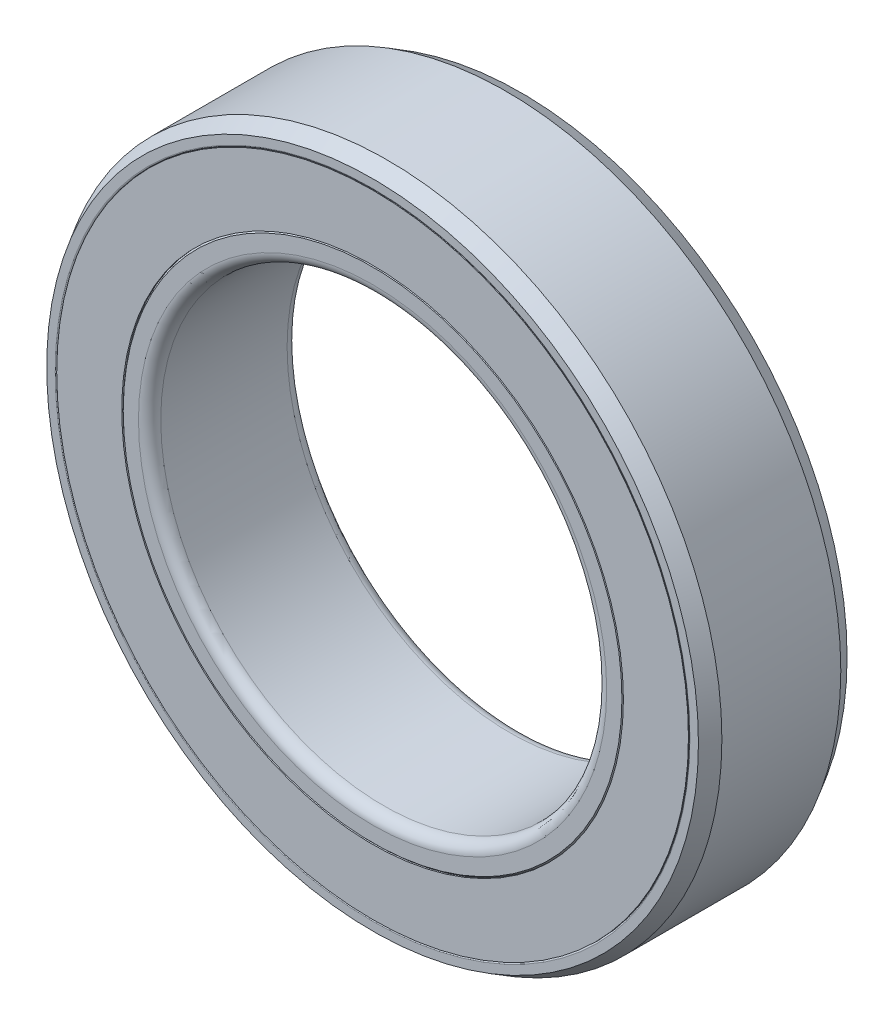
ISO-10303-21;
HEADER;
FILE_DESCRIPTION(('STEP AP214'),'2;1');
FILE_NAME('part.step','',(''),(''),'','','');
FILE_SCHEMA(('AUTOMOTIVE_DESIGN { 1 0 10303 214 1 1 1 1 }'));
ENDSEC;
DATA;
#1=APPLICATION_CONTEXT('core data for automotive mechanical design processes');
#2=APPLICATION_PROTOCOL_DEFINITION('international standard','automotive_design',2000,#1);
#3=PRODUCT_CONTEXT('',#1,'mechanical');
#4=PRODUCT('Part','Part','',(#3));
#5=PRODUCT_RELATED_PRODUCT_CATEGORY('part','',(#4));
#6=PRODUCT_DEFINITION_FORMATION('','',#4);
#7=PRODUCT_DEFINITION_CONTEXT('part definition',#1,'design');
#8=PRODUCT_DEFINITION('design','',#6,#7);
#9=PRODUCT_DEFINITION_SHAPE('','',#8);
#10=(LENGTH_UNIT() NAMED_UNIT(*) SI_UNIT(.MILLI.,.METRE.));
#11=(NAMED_UNIT(*) PLANE_ANGLE_UNIT() SI_UNIT($,.RADIAN.));
#12=(NAMED_UNIT(*) SI_UNIT($,.STERADIAN.) SOLID_ANGLE_UNIT());
#13=UNCERTAINTY_MEASURE_WITH_UNIT(LENGTH_MEASURE(1.E-05),#10,'distance_accuracy_value','');
#14=(GEOMETRIC_REPRESENTATION_CONTEXT(3) GLOBAL_UNCERTAINTY_ASSIGNED_CONTEXT((#13)) GLOBAL_UNIT_ASSIGNED_CONTEXT((#10,
#11,#12)) REPRESENTATION_CONTEXT('',''));
#15=CARTESIAN_POINT('',(0.,0.,0.));
#16=DIRECTION('',(0.,0.,1.));
#17=DIRECTION('',(1.,0.,0.));
#18=AXIS2_PLACEMENT_3D('',#15,#16,#17);
#19=CARTESIAN_POINT('',(5.96146505381867,-4.75410973917292,0.));
#20=DIRECTION('',(-0.781831482468022,0.623489801858743,0.));
#21=DIRECTION('',(0.,0.,1.));
#22=AXIS2_PLACEMENT_3D('',#19,#20,#21);
#23=SPHERICAL_SURFACE('',#22,1.20833333333333);
#24=CARTESIAN_POINT('',(5.01675201250314,-4.0007262285936,0.));
#25=VERTEX_POINT('',#24);
#26=VERTEX_LOOP('',#25);
#27=FACE_BOUND('',#26,.T.);
#28=ADVANCED_FACE('F44',(#27),#23,.T.);
#29=CLOSED_SHELL('',(#28));
#30=MANIFOLD_SOLID_BREP('B2',#29);
#31=CARTESIAN_POINT('',(7.43382533038642,1.69672212141683,0.));
#32=DIRECTION('',(-0.974927912181826,-0.222520933956305,0.));
#33=DIRECTION('',(0.,0.,1.));
#34=AXIS2_PLACEMENT_3D('',#31,#32,#33);
#35=SPHERICAL_SURFACE('',#34,1.20833333333333);
#36=CARTESIAN_POINT('',(6.25578743650005,1.42784265955296,0.));
#37=VERTEX_POINT('',#36);
#38=VERTEX_LOOP('',#37);
#39=FACE_BOUND('',#38,.T.);
#40=ADVANCED_FACE('F61',(#39),#35,.T.);
#41=CLOSED_SHELL('',(#40));
#42=MANIFOLD_SOLID_BREP('B6',#41);
#43=CARTESIAN_POINT('',(3.30836351077143,6.86988761775592,0.));
#44=DIRECTION('',(-0.433883739117565,-0.900968867902416,0.));
#45=DIRECTION('',(0.,0.,1.));
#46=AXIS2_PLACEMENT_3D('',#43,#44,#45);
#47=SPHERICAL_SURFACE('',#46,1.20833333333333);
#48=CARTESIAN_POINT('',(2.78408732600438,5.78121690237383,0.));
#49=VERTEX_POINT('',#48);
#50=VERTEX_LOOP('',#49);
#51=FACE_BOUND('',#50,.T.);
#52=ADVANCED_FACE('F78',(#51),#47,.T.);
#53=CLOSED_SHELL('',(#52));
#54=MANIFOLD_SOLID_BREP('B40',#53);
#55=CARTESIAN_POINT('',(-3.30836351077134,6.86988761775597,0.));
#56=DIRECTION('',(0.433883739117553,-0.900968867902422,0.));
#57=DIRECTION('',(0.,0.,1.));
#58=AXIS2_PLACEMENT_3D('',#55,#56,#57);
#59=SPHERICAL_SURFACE('',#58,1.20833333333333);
#60=CARTESIAN_POINT('',(-2.7840873260043,5.78121690237387,0.));
#61=VERTEX_POINT('',#60);
#62=VERTEX_LOOP('',#61);
#63=FACE_BOUND('',#62,.T.);
#64=ADVANCED_FACE('F95',(#63),#59,.T.);
#65=CLOSED_SHELL('',(#64));
#66=MANIFOLD_SOLID_BREP('B57',#65);
#67=CARTESIAN_POINT('',(-7.4338253303864,1.69672212141693,0.));
#68=DIRECTION('',(0.974927912181823,-0.222520933956318,0.));
#69=DIRECTION('',(0.,0.,1.));
#70=AXIS2_PLACEMENT_3D('',#67,#68,#69);
#71=SPHERICAL_SURFACE('',#70,1.20833333333333);
#72=CARTESIAN_POINT('',(-6.25578743650003,1.42784265955304,0.));
#73=VERTEX_POINT('',#72);
#74=VERTEX_LOOP('',#73);
#75=FACE_BOUND('',#74,.T.);
#76=ADVANCED_FACE('F112',(#75),#71,.T.);
#77=CLOSED_SHELL('',(#76));
#78=MANIFOLD_SOLID_BREP('B74',#77);
#79=CARTESIAN_POINT('',(-5.96146505381874,-4.75410973917283,0.));
#80=DIRECTION('',(0.781831482468031,0.623489801858732,0.));
#81=DIRECTION('',(0.,0.,1.));
#82=AXIS2_PLACEMENT_3D('',#79,#80,#81);
#83=SPHERICAL_SURFACE('',#82,1.20833333333333);
#84=CARTESIAN_POINT('',(-5.0167520125032,-4.00072622859353,0.));
#85=VERTEX_POINT('',#84);
#86=VERTEX_LOOP('',#85);
#87=FACE_BOUND('',#86,.T.);
#88=ADVANCED_FACE('F129',(#87),#83,.T.);
#89=CLOSED_SHELL('',(#88));
#90=MANIFOLD_SOLID_BREP('B91',#89);
#91=CARTESIAN_POINT('',(0.,-7.625,0.));
#92=DIRECTION('',(0.,1.,0.));
#93=DIRECTION('',(0.,0.,1.));
#94=AXIS2_PLACEMENT_3D('',#91,#92,#93);
#95=SPHERICAL_SURFACE('',#94,1.20833333333333);
#96=CARTESIAN_POINT('',(0.,-6.41666666666667,0.));
#97=VERTEX_POINT('',#96);
#98=VERTEX_LOOP('',#97);
#99=FACE_BOUND('',#98,.T.);
#100=ADVANCED_FACE('F148',(#99),#95,.T.);
#101=CLOSED_SHELL('',(#100));
#102=MANIFOLD_SOLID_BREP('B108',#101);
#103=CARTESIAN_POINT('',(0.,-6.75,2.));
#104=DIRECTION('',(0.,0.,1.));
#105=DIRECTION('',(1.,0.,0.));
#106=AXIS2_PLACEMENT_3D('',#103,#104,#105);
#107=PLANE('',#106);
#108=CARTESIAN_POINT('',(0.,0.,2.));
#109=DIRECTION('',(0.,0.,1.));
#110=DIRECTION('',(1.,0.,0.));
#111=AXIS2_PLACEMENT_3D('',#108,#109,#110);
#112=CIRCLE('',#111,8.5);
#113=CARTESIAN_POINT('',(8.5,0.,2.));
#114=VERTEX_POINT('',#113);
#115=EDGE_CURVE('E147',#114,#114,#112,.T.);
#116=ORIENTED_EDGE('',*,*,#115,.T.);
#117=EDGE_LOOP('',(#116));
#118=FACE_BOUND('',#117,.T.);
#119=CARTESIAN_POINT('',(0.,0.,2.));
#120=DIRECTION('',(0.,0.,1.));
#121=DIRECTION('',(1.,0.,0.));
#122=AXIS2_PLACEMENT_3D('',#119,#120,#121);
#123=CIRCLE('',#122,6.75);
#124=CARTESIAN_POINT('',(6.75,0.,2.));
#125=VERTEX_POINT('',#124);
#126=EDGE_CURVE('E181',#125,#125,#123,.T.);
#127=ORIENTED_EDGE('',*,*,#126,.F.);
#128=EDGE_LOOP('',(#127));
#129=FACE_BOUND('',#128,.T.);
#130=ADVANCED_FACE('F167',(#118,#129),#107,.T.);
#131=CARTESIAN_POINT('',(0.,0.,2.));
#132=DIRECTION('',(0.,0.,1.));
#133=DIRECTION('',(1.,0.,0.));
#134=AXIS2_PLACEMENT_3D('',#131,#132,#133);
#135=CYLINDRICAL_SURFACE('',#134,8.5);
#136=CARTESIAN_POINT('',(0.,0.,1.40625));
#137=DIRECTION('',(0.,0.,1.));
#138=DIRECTION('',(1.,0.,0.));
#139=AXIS2_PLACEMENT_3D('',#136,#137,#138);
#140=CIRCLE('',#139,8.5);
#141=CARTESIAN_POINT('',(8.5,0.,1.40625));
#142=VERTEX_POINT('',#141);
#143=EDGE_CURVE('E173',#142,#142,#140,.T.);
#144=ORIENTED_EDGE('',*,*,#143,.T.);
#145=EDGE_LOOP('',(#144));
#146=FACE_BOUND('',#145,.T.);
#147=ORIENTED_EDGE('',*,*,#115,.F.);
#148=EDGE_LOOP('',(#147));
#149=FACE_BOUND('',#148,.T.);
#150=ADVANCED_FACE('F191',(#146,#149),#135,.T.);
#151=CARTESIAN_POINT('',(0.,-6.75,1.40625));
#152=DIRECTION('',(0.,0.,-1.));
#153=DIRECTION('',(-1.,0.,0.));
#154=AXIS2_PLACEMENT_3D('',#151,#152,#153);
#155=PLANE('',#154);
#156=CARTESIAN_POINT('',(0.,0.,1.40625));
#157=DIRECTION('',(0.,0.,1.));
#158=DIRECTION('',(1.,0.,0.));
#159=AXIS2_PLACEMENT_3D('',#156,#157,#158);
#160=CIRCLE('',#159,6.75);
#161=CARTESIAN_POINT('',(6.75,0.,1.40625));
#162=VERTEX_POINT('',#161);
#163=EDGE_CURVE('E177',#162,#162,#160,.T.);
#164=ORIENTED_EDGE('',*,*,#163,.T.);
#165=EDGE_LOOP('',(#164));
#166=FACE_BOUND('',#165,.T.);
#167=ORIENTED_EDGE('',*,*,#143,.F.);
#168=EDGE_LOOP('',(#167));
#169=FACE_BOUND('',#168,.T.);
#170=ADVANCED_FACE('F195',(#166,#169),#155,.T.);
#171=CARTESIAN_POINT('',(0.,0.,2.));
#172=DIRECTION('',(0.,0.,1.));
#173=DIRECTION('',(1.,0.,0.));
#174=AXIS2_PLACEMENT_3D('',#171,#172,#173);
#175=CYLINDRICAL_SURFACE('',#174,6.75);
#176=ORIENTED_EDGE('',*,*,#126,.T.);
#177=EDGE_LOOP('',(#176));
#178=FACE_BOUND('',#177,.T.);
#179=ORIENTED_EDGE('',*,*,#163,.F.);
#180=EDGE_LOOP('',(#179));
#181=FACE_BOUND('',#180,.T.);
#182=ADVANCED_FACE('F187',(#178,#181),#175,.F.);
#183=CLOSED_SHELL('',(#130,#150,#170,#182));
#184=MANIFOLD_SOLID_BREP('B125_NOT_SHOWN',#183);
#185=CARTESIAN_POINT('',(0.,0.,1.7));
#186=DIRECTION('',(0.,0.,1.));
#187=DIRECTION('',(1.,0.,0.));
#188=AXIS2_PLACEMENT_3D('',#185,#186,#187);
#189=TOROIDAL_SURFACE('',#188,6.3,0.3);
#190=CARTESIAN_POINT('',(0.,0.,2.));
#191=DIRECTION('',(0.,0.,1.));
#192=DIRECTION('',(1.,0.,0.));
#193=AXIS2_PLACEMENT_3D('',#190,#191,#192);
#194=CIRCLE('',#193,6.3);
#195=CARTESIAN_POINT('',(6.3,0.,2.));
#196=VERTEX_POINT('',#195);
#197=EDGE_CURVE('E166',#196,#196,#194,.T.);
#198=ORIENTED_EDGE('',*,*,#197,.T.);
#199=EDGE_LOOP('',(#198));
#200=FACE_BOUND('',#199,.T.);
#201=CARTESIAN_POINT('',(0.,0.,1.7));
#202=DIRECTION('',(0.,0.,1.));
#203=DIRECTION('',(1.,0.,0.));
#204=AXIS2_PLACEMENT_3D('',#201,#202,#203);
#205=CIRCLE('',#204,6.);
#206=CARTESIAN_POINT('',(6.,0.,1.7));
#207=VERTEX_POINT('',#206);
#208=EDGE_CURVE('E262',#207,#207,#205,.T.);
#209=ORIENTED_EDGE('',*,*,#208,.F.);
#210=EDGE_LOOP('',(#209));
#211=FACE_BOUND('',#210,.T.);
#212=ADVANCED_FACE('F228',(#200,#211),#189,.T.);
#213=CARTESIAN_POINT('',(0.,-6.71,2.));
#214=DIRECTION('',(0.,0.,1.));
#215=DIRECTION('',(1.,0.,0.));
#216=AXIS2_PLACEMENT_3D('',#213,#214,#215);
#217=PLANE('',#216);
#218=CARTESIAN_POINT('',(0.,0.,2.));
#219=DIRECTION('',(0.,0.,1.));
#220=DIRECTION('',(1.,0.,0.));
#221=AXIS2_PLACEMENT_3D('',#218,#219,#220);
#222=CIRCLE('',#221,6.71);
#223=CARTESIAN_POINT('',(6.71,0.,2.));
#224=VERTEX_POINT('',#223);
#225=EDGE_CURVE('E234',#224,#224,#222,.T.);
#226=ORIENTED_EDGE('',*,*,#225,.T.);
#227=EDGE_LOOP('',(#226));
#228=FACE_BOUND('',#227,.T.);
#229=ORIENTED_EDGE('',*,*,#197,.F.);
#230=EDGE_LOOP('',(#229));
#231=FACE_BOUND('',#230,.T.);
#232=ADVANCED_FACE('F270',(#228,#231),#217,.T.);
#233=CARTESIAN_POINT('',(0.,0.,2.));
#234=DIRECTION('',(0.,0.,-1.));
#235=DIRECTION('',(-1.,0.,0.));
#236=AXIS2_PLACEMENT_3D('',#233,#234,#235);
#237=CONICAL_SURFACE('',#236,6.71,0.785398163397448);
#238=CARTESIAN_POINT('',(0.,0.,1.96));
#239=DIRECTION('',(0.,0.,1.));
#240=DIRECTION('',(1.,0.,0.));
#241=AXIS2_PLACEMENT_3D('',#238,#239,#240);
#242=CIRCLE('',#241,6.75);
#243=CARTESIAN_POINT('',(6.75,0.,1.96));
#244=VERTEX_POINT('',#243);
#245=EDGE_CURVE('E238',#244,#244,#242,.T.);
#246=ORIENTED_EDGE('',*,*,#245,.T.);
#247=EDGE_LOOP('',(#246));
#248=FACE_BOUND('',#247,.T.);
#249=ORIENTED_EDGE('',*,*,#225,.F.);
#250=EDGE_LOOP('',(#249));
#251=FACE_BOUND('',#250,.T.);
#252=ADVANCED_FACE('F274',(#248,#251),#237,.T.);
#253=CARTESIAN_POINT('',(0.,0.,2.));
#254=DIRECTION('',(0.,0.,1.));
#255=DIRECTION('',(1.,0.,0.));
#256=AXIS2_PLACEMENT_3D('',#253,#254,#255);
#257=CYLINDRICAL_SURFACE('',#256,6.75);
#258=CARTESIAN_POINT('',(0.,0.,0.833333333333334));
#259=DIRECTION('',(0.,0.,1.));
#260=DIRECTION('',(1.,0.,0.));
#261=AXIS2_PLACEMENT_3D('',#258,#259,#260);
#262=CIRCLE('',#261,6.75);
#263=CARTESIAN_POINT('',(6.75,0.,0.833333333333334));
#264=VERTEX_POINT('',#263);
#265=EDGE_CURVE('E242',#264,#264,#262,.T.);
#266=ORIENTED_EDGE('',*,*,#265,.T.);
#267=EDGE_LOOP('',(#266));
#268=FACE_BOUND('',#267,.T.);
#269=ORIENTED_EDGE('',*,*,#245,.F.);
#270=EDGE_LOOP('',(#269));
#271=FACE_BOUND('',#270,.T.);
#272=ADVANCED_FACE('F278',(#268,#271),#257,.T.);
#273=CARTESIAN_POINT('',(0.,0.,0.));
#274=DIRECTION('',(0.,0.,1.));
#275=DIRECTION('',(1.,0.,0.));
#276=AXIS2_PLACEMENT_3D('',#273,#274,#275);
#277=TOROIDAL_SURFACE('',#276,7.625,1.20833333333333);
#278=CARTESIAN_POINT('',(0.,0.,-0.833333333333333));
#279=DIRECTION('',(0.,0.,1.));
#280=DIRECTION('',(1.,0.,0.));
#281=AXIS2_PLACEMENT_3D('',#278,#279,#280);
#282=CIRCLE('',#281,6.75);
#283=CARTESIAN_POINT('',(6.75,0.,-0.833333333333333));
#284=VERTEX_POINT('',#283);
#285=EDGE_CURVE('E247',#284,#284,#282,.T.);
#286=ORIENTED_EDGE('',*,*,#285,.T.);
#287=EDGE_LOOP('',(#286));
#288=FACE_BOUND('',#287,.T.);
#289=ORIENTED_EDGE('',*,*,#265,.F.);
#290=EDGE_LOOP('',(#289));
#291=FACE_BOUND('',#290,.T.);
#292=ADVANCED_FACE('F285',(#288,#291),#277,.F.);
#293=CARTESIAN_POINT('',(0.,0.,2.));
#294=DIRECTION('',(0.,0.,1.));
#295=DIRECTION('',(1.,0.,0.));
#296=AXIS2_PLACEMENT_3D('',#293,#294,#295);
#297=CYLINDRICAL_SURFACE('',#296,6.75);
#298=CARTESIAN_POINT('',(0.,0.,-1.96));
#299=DIRECTION('',(0.,0.,1.));
#300=DIRECTION('',(1.,0.,0.));
#301=AXIS2_PLACEMENT_3D('',#298,#299,#300);
#302=CIRCLE('',#301,6.75);
#303=CARTESIAN_POINT('',(6.75,0.,-1.96));
#304=VERTEX_POINT('',#303);
#305=EDGE_CURVE('E250',#304,#304,#302,.T.);
#306=ORIENTED_EDGE('',*,*,#305,.T.);
#307=EDGE_LOOP('',(#306));
#308=FACE_BOUND('',#307,.T.);
#309=ORIENTED_EDGE('',*,*,#285,.F.);
#310=EDGE_LOOP('',(#309));
#311=FACE_BOUND('',#310,.T.);
#312=ADVANCED_FACE('F289',(#308,#311),#297,.T.);
#313=CARTESIAN_POINT('',(0.,0.,-1.96));
#314=DIRECTION('',(0.,0.,1.));
#315=DIRECTION('',(1.,0.,0.));
#316=AXIS2_PLACEMENT_3D('',#313,#314,#315);
#317=CONICAL_SURFACE('',#316,6.75,0.785398163397459);
#318=CARTESIAN_POINT('',(0.,0.,-2.));
#319=DIRECTION('',(0.,0.,1.));
#320=DIRECTION('',(1.,0.,0.));
#321=AXIS2_PLACEMENT_3D('',#318,#319,#320);
#322=CIRCLE('',#321,6.71);
#323=CARTESIAN_POINT('',(6.71,0.,-2.));
#324=VERTEX_POINT('',#323);
#325=EDGE_CURVE('E253',#324,#324,#322,.T.);
#326=ORIENTED_EDGE('',*,*,#325,.T.);
#327=EDGE_LOOP('',(#326));
#328=FACE_BOUND('',#327,.T.);
#329=ORIENTED_EDGE('',*,*,#305,.F.);
#330=EDGE_LOOP('',(#329));
#331=FACE_BOUND('',#330,.T.);
#332=ADVANCED_FACE('F293',(#328,#331),#317,.T.);
#333=CARTESIAN_POINT('',(0.,-6.71,-2.));
#334=DIRECTION('',(0.,0.,-1.));
#335=DIRECTION('',(-1.,0.,0.));
#336=AXIS2_PLACEMENT_3D('',#333,#334,#335);
#337=PLANE('',#336);
#338=CARTESIAN_POINT('',(0.,0.,-2.));
#339=DIRECTION('',(0.,0.,1.));
#340=DIRECTION('',(1.,0.,0.));
#341=AXIS2_PLACEMENT_3D('',#338,#339,#340);
#342=CIRCLE('',#341,6.3);
#343=CARTESIAN_POINT('',(6.3,0.,-2.));
#344=VERTEX_POINT('',#343);
#345=EDGE_CURVE('E256',#344,#344,#342,.T.);
#346=ORIENTED_EDGE('',*,*,#345,.T.);
#347=EDGE_LOOP('',(#346));
#348=FACE_BOUND('',#347,.T.);
#349=ORIENTED_EDGE('',*,*,#325,.F.);
#350=EDGE_LOOP('',(#349));
#351=FACE_BOUND('',#350,.T.);
#352=ADVANCED_FACE('F297',(#348,#351),#337,.T.);
#353=CARTESIAN_POINT('',(0.,0.,-1.7));
#354=DIRECTION('',(0.,0.,1.));
#355=DIRECTION('',(1.,0.,0.));
#356=AXIS2_PLACEMENT_3D('',#353,#354,#355);
#357=TOROIDAL_SURFACE('',#356,6.3,0.3);
#358=CARTESIAN_POINT('',(0.,0.,-1.7));
#359=DIRECTION('',(0.,0.,1.));
#360=DIRECTION('',(1.,0.,0.));
#361=AXIS2_PLACEMENT_3D('',#358,#359,#360);
#362=CIRCLE('',#361,6.);
#363=CARTESIAN_POINT('',(6.,0.,-1.7));
#364=VERTEX_POINT('',#363);
#365=EDGE_CURVE('E259',#364,#364,#362,.T.);
#366=ORIENTED_EDGE('',*,*,#365,.T.);
#367=EDGE_LOOP('',(#366));
#368=FACE_BOUND('',#367,.T.);
#369=ORIENTED_EDGE('',*,*,#345,.F.);
#370=EDGE_LOOP('',(#369));
#371=FACE_BOUND('',#370,.T.);
#372=ADVANCED_FACE('F301',(#368,#371),#357,.T.);
#373=CARTESIAN_POINT('',(0.,0.,2.));
#374=DIRECTION('',(0.,0.,1.));
#375=DIRECTION('',(1.,0.,0.));
#376=AXIS2_PLACEMENT_3D('',#373,#374,#375);
#377=CYLINDRICAL_SURFACE('',#376,6.);
#378=ORIENTED_EDGE('',*,*,#208,.T.);
#379=EDGE_LOOP('',(#378));
#380=FACE_BOUND('',#379,.T.);
#381=ORIENTED_EDGE('',*,*,#365,.F.);
#382=EDGE_LOOP('',(#381));
#383=FACE_BOUND('',#382,.T.);
#384=ADVANCED_FACE('F266',(#380,#383),#377,.F.);
#385=CLOSED_SHELL('',(#212,#232,#252,#272,#292,#312,#332,#352,#372,#384));
#386=MANIFOLD_SOLID_BREP('B142',#385);
#387=CARTESIAN_POINT('',(0.,0.,2.));
#388=DIRECTION('',(0.,0.,-1.));
#389=DIRECTION('',(-1.,0.,0.));
#390=AXIS2_PLACEMENT_3D('',#387,#388,#389);
#391=CONICAL_SURFACE('',#390,8.76905989232416,0.523598775598282);
#392=CARTESIAN_POINT('',(0.,0.,1.6));
#393=DIRECTION('',(0.,0.,1.));
#394=DIRECTION('',(1.,0.,0.));
#395=AXIS2_PLACEMENT_3D('',#392,#393,#394);
#396=CIRCLE('',#395,9.);
#397=CARTESIAN_POINT('',(9.,0.,1.6));
#398=VERTEX_POINT('',#397);
#399=EDGE_CURVE('E227',#398,#398,#396,.T.);
#400=ORIENTED_EDGE('',*,*,#399,.T.);
#401=EDGE_LOOP('',(#400));
#402=FACE_BOUND('',#401,.T.);
#403=CARTESIAN_POINT('',(0.,0.,2.));
#404=DIRECTION('',(0.,0.,1.));
#405=DIRECTION('',(1.,0.,0.));
#406=AXIS2_PLACEMENT_3D('',#403,#404,#405);
#407=CIRCLE('',#406,8.76905989232416);
#408=CARTESIAN_POINT('',(8.76905989232416,0.,2.));
#409=VERTEX_POINT('',#408);
#410=EDGE_CURVE('E394',#409,#409,#407,.T.);
#411=ORIENTED_EDGE('',*,*,#410,.F.);
#412=EDGE_LOOP('',(#411));
#413=FACE_BOUND('',#412,.T.);
#414=ADVANCED_FACE('F360',(#402,#413),#391,.T.);
#415=CARTESIAN_POINT('',(0.,0.,2.));
#416=DIRECTION('',(0.,0.,1.));
#417=DIRECTION('',(1.,0.,0.));
#418=AXIS2_PLACEMENT_3D('',#415,#416,#417);
#419=CYLINDRICAL_SURFACE('',#418,9.);
#420=CARTESIAN_POINT('',(0.,0.,-1.6));
#421=DIRECTION('',(0.,0.,1.));
#422=DIRECTION('',(1.,0.,0.));
#423=AXIS2_PLACEMENT_3D('',#420,#421,#422);
#424=CIRCLE('',#423,9.);
#425=CARTESIAN_POINT('',(9.,0.,-1.6));
#426=VERTEX_POINT('',#425);
#427=EDGE_CURVE('E366',#426,#426,#424,.T.);
#428=ORIENTED_EDGE('',*,*,#427,.T.);
#429=EDGE_LOOP('',(#428));
#430=FACE_BOUND('',#429,.T.);
#431=ORIENTED_EDGE('',*,*,#399,.F.);
#432=EDGE_LOOP('',(#431));
#433=FACE_BOUND('',#432,.T.);
#434=ADVANCED_FACE('F402',(#430,#433),#419,.T.);
#435=CARTESIAN_POINT('',(0.,0.,-1.6));
#436=DIRECTION('',(0.,0.,1.));
#437=DIRECTION('',(1.,0.,0.));
#438=AXIS2_PLACEMENT_3D('',#435,#436,#437);
#439=CONICAL_SURFACE('',#438,9.,0.523598775598281);
#440=CARTESIAN_POINT('',(0.,0.,-2.));
#441=DIRECTION('',(0.,0.,1.));
#442=DIRECTION('',(1.,0.,0.));
#443=AXIS2_PLACEMENT_3D('',#440,#441,#442);
#444=CIRCLE('',#443,8.76905989232416);
#445=CARTESIAN_POINT('',(8.76905989232416,0.,-2.));
#446=VERTEX_POINT('',#445);
#447=EDGE_CURVE('E370',#446,#446,#444,.T.);
#448=ORIENTED_EDGE('',*,*,#447,.T.);
#449=EDGE_LOOP('',(#448));
#450=FACE_BOUND('',#449,.T.);
#451=ORIENTED_EDGE('',*,*,#427,.F.);
#452=EDGE_LOOP('',(#451));
#453=FACE_BOUND('',#452,.T.);
#454=ADVANCED_FACE('F406',(#450,#453),#439,.T.);
#455=CARTESIAN_POINT('',(0.,-8.54,-2.));
#456=DIRECTION('',(0.,0.,-1.));
#457=DIRECTION('',(-1.,0.,0.));
#458=AXIS2_PLACEMENT_3D('',#455,#456,#457);
#459=PLANE('',#458);
#460=CARTESIAN_POINT('',(0.,0.,-2.));
#461=DIRECTION('',(0.,0.,1.));
#462=DIRECTION('',(1.,0.,0.));
#463=AXIS2_PLACEMENT_3D('',#460,#461,#462);
#464=CIRCLE('',#463,8.54);
#465=CARTESIAN_POINT('',(8.54,0.,-2.));
#466=VERTEX_POINT('',#465);
#467=EDGE_CURVE('E374',#466,#466,#464,.T.);
#468=ORIENTED_EDGE('',*,*,#467,.T.);
#469=EDGE_LOOP('',(#468));
#470=FACE_BOUND('',#469,.T.);
#471=ORIENTED_EDGE('',*,*,#447,.F.);
#472=EDGE_LOOP('',(#471));
#473=FACE_BOUND('',#472,.T.);
#474=ADVANCED_FACE('F410',(#470,#473),#459,.T.);
#475=CARTESIAN_POINT('',(0.,0.,-1.96));
#476=DIRECTION('',(0.,0.,1.));
#477=DIRECTION('',(1.,0.,0.));
#478=AXIS2_PLACEMENT_3D('',#475,#476,#477);
#479=TOROIDAL_SURFACE('',#478,8.54,0.0399999999999999);
#480=CARTESIAN_POINT('',(0.,0.,-1.96));
#481=DIRECTION('',(0.,0.,1.));
#482=DIRECTION('',(1.,0.,0.));
#483=AXIS2_PLACEMENT_3D('',#480,#481,#482);
#484=CIRCLE('',#483,8.5);
#485=CARTESIAN_POINT('',(8.5,0.,-1.96));
#486=VERTEX_POINT('',#485);
#487=EDGE_CURVE('E379',#486,#486,#484,.T.);
#488=ORIENTED_EDGE('',*,*,#487,.T.);
#489=EDGE_LOOP('',(#488));
#490=FACE_BOUND('',#489,.T.);
#491=ORIENTED_EDGE('',*,*,#467,.F.);
#492=EDGE_LOOP('',(#491));
#493=FACE_BOUND('',#492,.T.);
#494=ADVANCED_FACE('F417',(#490,#493),#479,.T.);
#495=CARTESIAN_POINT('',(0.,0.,2.));
#496=DIRECTION('',(0.,0.,1.));
#497=DIRECTION('',(1.,0.,0.));
#498=AXIS2_PLACEMENT_3D('',#495,#496,#497);
#499=CYLINDRICAL_SURFACE('',#498,8.5);
#500=CARTESIAN_POINT('',(0.,0.,-0.833333333333333));
#501=DIRECTION('',(0.,0.,1.));
#502=DIRECTION('',(1.,0.,0.));
#503=AXIS2_PLACEMENT_3D('',#500,#501,#502);
#504=CIRCLE('',#503,8.5);
#505=CARTESIAN_POINT('',(8.5,0.,-0.833333333333333));
#506=VERTEX_POINT('',#505);
#507=EDGE_CURVE('E382',#506,#506,#504,.T.);
#508=ORIENTED_EDGE('',*,*,#507,.T.);
#509=EDGE_LOOP('',(#508));
#510=FACE_BOUND('',#509,.T.);
#511=ORIENTED_EDGE('',*,*,#487,.F.);
#512=EDGE_LOOP('',(#511));
#513=FACE_BOUND('',#512,.T.);
#514=ADVANCED_FACE('F421',(#510,#513),#499,.F.);
#515=CARTESIAN_POINT('',(0.,0.,0.));
#516=DIRECTION('',(0.,0.,1.));
#517=DIRECTION('',(1.,0.,0.));
#518=AXIS2_PLACEMENT_3D('',#515,#516,#517);
#519=TOROIDAL_SURFACE('',#518,7.625,1.20833333333333);
#520=CARTESIAN_POINT('',(0.,0.,0.833333333333333));
#521=DIRECTION('',(0.,0.,1.));
#522=DIRECTION('',(1.,0.,0.));
#523=AXIS2_PLACEMENT_3D('',#520,#521,#522);
#524=CIRCLE('',#523,8.5);
#525=CARTESIAN_POINT('',(8.5,0.,0.833333333333333));
#526=VERTEX_POINT('',#525);
#527=EDGE_CURVE('E385',#526,#526,#524,.T.);
#528=ORIENTED_EDGE('',*,*,#527,.T.);
#529=EDGE_LOOP('',(#528));
#530=FACE_BOUND('',#529,.T.);
#531=ORIENTED_EDGE('',*,*,#507,.F.);
#532=EDGE_LOOP('',(#531));
#533=FACE_BOUND('',#532,.T.);
#534=ADVANCED_FACE('F425',(#530,#533),#519,.F.);
#535=CARTESIAN_POINT('',(0.,0.,2.));
#536=DIRECTION('',(0.,0.,1.));
#537=DIRECTION('',(1.,0.,0.));
#538=AXIS2_PLACEMENT_3D('',#535,#536,#537);
#539=CYLINDRICAL_SURFACE('',#538,8.5);
#540=CARTESIAN_POINT('',(0.,0.,1.96));
#541=DIRECTION('',(0.,0.,1.));
#542=DIRECTION('',(1.,0.,0.));
#543=AXIS2_PLACEMENT_3D('',#540,#541,#542);
#544=CIRCLE('',#543,8.5);
#545=CARTESIAN_POINT('',(8.5,0.,1.96));
#546=VERTEX_POINT('',#545);
#547=EDGE_CURVE('E388',#546,#546,#544,.T.);
#548=ORIENTED_EDGE('',*,*,#547,.T.);
#549=EDGE_LOOP('',(#548));
#550=FACE_BOUND('',#549,.T.);
#551=ORIENTED_EDGE('',*,*,#527,.F.);
#552=EDGE_LOOP('',(#551));
#553=FACE_BOUND('',#552,.T.);
#554=ADVANCED_FACE('F429',(#550,#553),#539,.F.);
#555=CARTESIAN_POINT('',(0.,0.,1.96));
#556=DIRECTION('',(0.,0.,1.));
#557=DIRECTION('',(1.,0.,0.));
#558=AXIS2_PLACEMENT_3D('',#555,#556,#557);
#559=TOROIDAL_SURFACE('',#558,8.54,0.0399999999999999);
#560=CARTESIAN_POINT('',(0.,0.,2.));
#561=DIRECTION('',(0.,0.,1.));
#562=DIRECTION('',(1.,0.,0.));
#563=AXIS2_PLACEMENT_3D('',#560,#561,#562);
#564=CIRCLE('',#563,8.54);
#565=CARTESIAN_POINT('',(8.54,0.,2.));
#566=VERTEX_POINT('',#565);
#567=EDGE_CURVE('E391',#566,#566,#564,.T.);
#568=ORIENTED_EDGE('',*,*,#567,.T.);
#569=EDGE_LOOP('',(#568));
#570=FACE_BOUND('',#569,.T.);
#571=ORIENTED_EDGE('',*,*,#547,.F.);
#572=EDGE_LOOP('',(#571));
#573=FACE_BOUND('',#572,.T.);
#574=ADVANCED_FACE('F433',(#570,#573),#559,.T.);
#575=CARTESIAN_POINT('',(0.,-8.54,2.));
#576=DIRECTION('',(0.,0.,1.));
#577=DIRECTION('',(1.,0.,0.));
#578=AXIS2_PLACEMENT_3D('',#575,#576,#577);
#579=PLANE('',#578);
#580=ORIENTED_EDGE('',*,*,#410,.T.);
#581=EDGE_LOOP('',(#580));
#582=FACE_BOUND('',#581,.T.);
#583=ORIENTED_EDGE('',*,*,#567,.F.);
#584=EDGE_LOOP('',(#583));
#585=FACE_BOUND('',#584,.T.);
#586=ADVANCED_FACE('F398',(#582,#585),#579,.T.);
#587=CLOSED_SHELL('',(#414,#434,#454,#474,#494,#514,#534,#554,#574,#586));
#588=MANIFOLD_SOLID_BREP('B161',#587);
#589=ADVANCED_BREP_SHAPE_REPRESENTATION('',(#18,#30,#42,#54,#66,#78,#90,#102,#184,#386,#588),#14);
#590=SHAPE_DEFINITION_REPRESENTATION(#9,#589);
ENDSEC;
END-ISO-10303-21;
